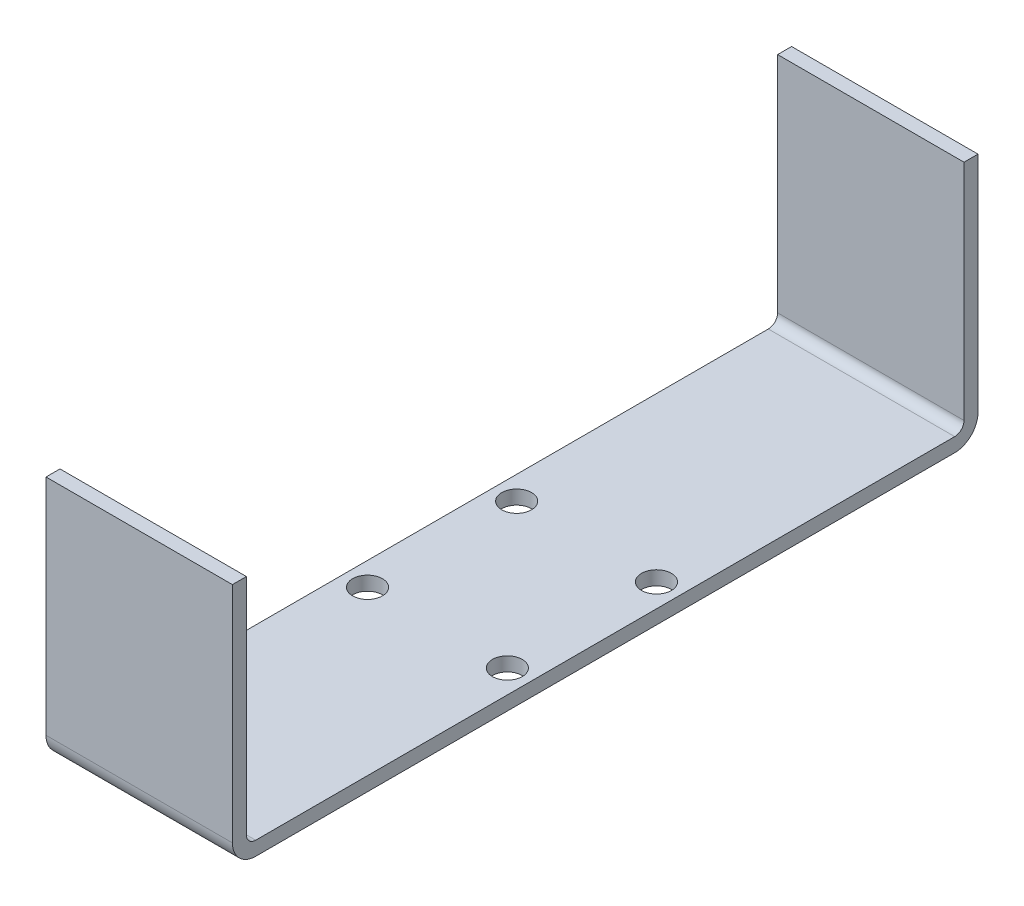
ISO-10303-21;
HEADER;
FILE_DESCRIPTION(('STEP AP214'),'2;1');
FILE_NAME('part.step','',(''),(''),'','','');
FILE_SCHEMA(('AUTOMOTIVE_DESIGN { 1 0 10303 214 1 1 1 1 }'));
ENDSEC;
DATA;
#1=APPLICATION_CONTEXT('core data for automotive mechanical design processes');
#2=APPLICATION_PROTOCOL_DEFINITION('international standard','automotive_design',2000,#1);
#3=PRODUCT_CONTEXT('',#1,'mechanical');
#4=PRODUCT('Part','Part','',(#3));
#5=PRODUCT_RELATED_PRODUCT_CATEGORY('part','',(#4));
#6=PRODUCT_DEFINITION_FORMATION('','',#4);
#7=PRODUCT_DEFINITION_CONTEXT('part definition',#1,'design');
#8=PRODUCT_DEFINITION('design','',#6,#7);
#9=PRODUCT_DEFINITION_SHAPE('','',#8);
#10=(LENGTH_UNIT() NAMED_UNIT(*) SI_UNIT(.MILLI.,.METRE.));
#11=(NAMED_UNIT(*) PLANE_ANGLE_UNIT() SI_UNIT($,.RADIAN.));
#12=(NAMED_UNIT(*) SI_UNIT($,.STERADIAN.) SOLID_ANGLE_UNIT());
#13=UNCERTAINTY_MEASURE_WITH_UNIT(LENGTH_MEASURE(1.E-05),#10,'distance_accuracy_value','');
#14=(GEOMETRIC_REPRESENTATION_CONTEXT(3) GLOBAL_UNCERTAINTY_ASSIGNED_CONTEXT((#13)) GLOBAL_UNIT_ASSIGNED_CONTEXT((#10,
#11,#12)) REPRESENTATION_CONTEXT('',''));
#15=CARTESIAN_POINT('',(0.,0.,0.));
#16=DIRECTION('',(0.,0.,1.));
#17=DIRECTION('',(1.,0.,0.));
#18=AXIS2_PLACEMENT_3D('',#15,#16,#17);
#19=CARTESIAN_POINT('',(0.,1.5,0.));
#20=DIRECTION('',(0.,1.,0.));
#21=DIRECTION('',(0.,0.,1.));
#22=AXIS2_PLACEMENT_3D('',#19,#20,#21);
#23=PLANE('',#22);
#24=CARTESIAN_POINT('',(-7.50000000000001,1.5,8.));
#25=DIRECTION('',(0.,1.,0.));
#26=DIRECTION('',(0.,0.,1.));
#27=AXIS2_PLACEMENT_3D('',#24,#25,#26);
#28=CIRCLE('',#27,1.60000000000001);
#29=CARTESIAN_POINT('',(-7.50000000000001,1.5,9.60000000000001));
#30=VERTEX_POINT('',#29);
#31=EDGE_CURVE('E205',#30,#30,#28,.T.);
#32=ORIENTED_EDGE('',*,*,#31,.F.);
#33=EDGE_LOOP('',(#32));
#34=FACE_BOUND('',#33,.T.);
#35=CARTESIAN_POINT('',(-7.50000000000001,1.5,-8.));
#36=DIRECTION('',(0.,1.,0.));
#37=DIRECTION('',(0.,0.,1.));
#38=AXIS2_PLACEMENT_3D('',#35,#36,#37);
#39=CIRCLE('',#38,1.60000000000001);
#40=CARTESIAN_POINT('',(-7.50000000000001,1.5,-6.39999999999999));
#41=VERTEX_POINT('',#40);
#42=EDGE_CURVE('E221',#41,#41,#39,.T.);
#43=ORIENTED_EDGE('',*,*,#42,.F.);
#44=EDGE_LOOP('',(#43));
#45=FACE_BOUND('',#44,.T.);
#46=CARTESIAN_POINT('',(7.49999999999999,1.5,-8.));
#47=DIRECTION('',(0.,1.,0.));
#48=DIRECTION('',(0.,0.,1.));
#49=AXIS2_PLACEMENT_3D('',#46,#47,#48);
#50=CIRCLE('',#49,1.6);
#51=CARTESIAN_POINT('',(7.49999999999999,1.5,-6.4));
#52=VERTEX_POINT('',#51);
#53=EDGE_CURVE('E213',#52,#52,#50,.T.);
#54=ORIENTED_EDGE('',*,*,#53,.F.);
#55=EDGE_LOOP('',(#54));
#56=FACE_BOUND('',#55,.T.);
#57=CARTESIAN_POINT('',(7.49999999999999,1.5,8.));
#58=DIRECTION('',(0.,1.,0.));
#59=DIRECTION('',(0.,0.,1.));
#60=AXIS2_PLACEMENT_3D('',#57,#58,#59);
#61=CIRCLE('',#60,1.60000000000001);
#62=CARTESIAN_POINT('',(7.49999999999999,1.5,9.60000000000001));
#63=VERTEX_POINT('',#62);
#64=EDGE_CURVE('E197',#63,#63,#61,.T.);
#65=ORIENTED_EDGE('',*,*,#64,.F.);
#66=EDGE_LOOP('',(#65));
#67=FACE_BOUND('',#66,.T.);
#68=DIRECTION('',(0.,0.,-1.));
#69=VECTOR('',#68,1.);
#70=CARTESIAN_POINT('',(10.,1.5,-40.));
#71=LINE('',#70,#69);
#72=CARTESIAN_POINT('',(10.,1.5,37.5));
#73=VERTEX_POINT('',#72);
#74=CARTESIAN_POINT('',(10.,1.5,-37.5));
#75=VERTEX_POINT('',#74);
#76=EDGE_CURVE('E229',#73,#75,#71,.T.);
#77=ORIENTED_EDGE('',*,*,#76,.T.);
#78=DIRECTION('',(1.,0.,0.));
#79=VECTOR('',#78,1.);
#80=CARTESIAN_POINT('',(0.,1.5,-37.5));
#81=LINE('',#80,#79);
#82=CARTESIAN_POINT('',(-10.,1.5,-37.5));
#83=VERTEX_POINT('',#82);
#84=EDGE_CURVE('E257',#75,#83,#81,.F.);
#85=ORIENTED_EDGE('',*,*,#84,.T.);
#86=DIRECTION('',(0.,0.,1.));
#87=VECTOR('',#86,1.);
#88=CARTESIAN_POINT('',(-10.,1.5,-40.));
#89=LINE('',#88,#87);
#90=CARTESIAN_POINT('',(-10.,1.5,37.5));
#91=VERTEX_POINT('',#90);
#92=EDGE_CURVE('E233',#83,#91,#89,.T.);
#93=ORIENTED_EDGE('',*,*,#92,.T.);
#94=DIRECTION('',(-1.,0.,0.));
#95=VECTOR('',#94,1.);
#96=CARTESIAN_POINT('',(0.,1.5,37.5));
#97=LINE('',#96,#95);
#98=EDGE_CURVE('E254',#91,#73,#97,.F.);
#99=ORIENTED_EDGE('',*,*,#98,.T.);
#100=EDGE_LOOP('',(#77,#85,#93,#99));
#101=FACE_BOUND('',#100,.T.);
#102=ADVANCED_FACE('F39',(#34,#45,#56,#67,#101),#23,.T.);
#103=CARTESIAN_POINT('',(0.,0.,0.));
#104=DIRECTION('',(0.,1.,0.));
#105=DIRECTION('',(0.,0.,1.));
#106=AXIS2_PLACEMENT_3D('',#103,#104,#105);
#107=PLANE('',#106);
#108=DIRECTION('',(0.,0.,1.));
#109=VECTOR('',#108,1.);
#110=CARTESIAN_POINT('',(-10.,0.,-40.));
#111=LINE('',#110,#109);
#112=CARTESIAN_POINT('',(-10.,0.,-37.5));
#113=VERTEX_POINT('',#112);
#114=CARTESIAN_POINT('',(-10.,0.,37.5));
#115=VERTEX_POINT('',#114);
#116=EDGE_CURVE('E234',#113,#115,#111,.T.);
#117=ORIENTED_EDGE('',*,*,#116,.F.);
#118=DIRECTION('',(-1.,0.,0.));
#119=VECTOR('',#118,1.);
#120=CARTESIAN_POINT('',(0.,0.,-37.5));
#121=LINE('',#120,#119);
#122=CARTESIAN_POINT('',(10.,0.,-37.5));
#123=VERTEX_POINT('',#122);
#124=EDGE_CURVE('E62',#113,#123,#121,.F.);
#125=ORIENTED_EDGE('',*,*,#124,.T.);
#126=DIRECTION('',(0.,0.,-1.));
#127=VECTOR('',#126,1.);
#128=CARTESIAN_POINT('',(10.,0.,-40.));
#129=LINE('',#128,#127);
#130=CARTESIAN_POINT('',(10.,0.,37.5));
#131=VERTEX_POINT('',#130);
#132=EDGE_CURVE('E225',#131,#123,#129,.T.);
#133=ORIENTED_EDGE('',*,*,#132,.F.);
#134=DIRECTION('',(1.,0.,0.));
#135=VECTOR('',#134,1.);
#136=CARTESIAN_POINT('',(0.,0.,37.5));
#137=LINE('',#136,#135);
#138=EDGE_CURVE('E285',#131,#115,#137,.F.);
#139=ORIENTED_EDGE('',*,*,#138,.T.);
#140=EDGE_LOOP('',(#117,#125,#133,#139));
#141=FACE_BOUND('',#140,.T.);
#142=CARTESIAN_POINT('',(-7.50000000000001,0.,-8.));
#143=DIRECTION('',(0.,1.,0.));
#144=DIRECTION('',(0.,0.,1.));
#145=AXIS2_PLACEMENT_3D('',#142,#143,#144);
#146=CIRCLE('',#145,1.60000000000001);
#147=CARTESIAN_POINT('',(-7.50000000000001,0.,-6.39999999999999));
#148=VERTEX_POINT('',#147);
#149=EDGE_CURVE('E217',#148,#148,#146,.T.);
#150=ORIENTED_EDGE('',*,*,#149,.T.);
#151=EDGE_LOOP('',(#150));
#152=FACE_BOUND('',#151,.T.);
#153=CARTESIAN_POINT('',(7.49999999999999,0.,-8.));
#154=DIRECTION('',(0.,1.,0.));
#155=DIRECTION('',(0.,0.,1.));
#156=AXIS2_PLACEMENT_3D('',#153,#154,#155);
#157=CIRCLE('',#156,1.6);
#158=CARTESIAN_POINT('',(7.49999999999999,0.,-6.4));
#159=VERTEX_POINT('',#158);
#160=EDGE_CURVE('E209',#159,#159,#157,.T.);
#161=ORIENTED_EDGE('',*,*,#160,.T.);
#162=EDGE_LOOP('',(#161));
#163=FACE_BOUND('',#162,.T.);
#164=CARTESIAN_POINT('',(-7.50000000000001,0.,8.));
#165=DIRECTION('',(0.,1.,0.));
#166=DIRECTION('',(0.,0.,1.));
#167=AXIS2_PLACEMENT_3D('',#164,#165,#166);
#168=CIRCLE('',#167,1.60000000000001);
#169=CARTESIAN_POINT('',(-7.50000000000001,0.,9.60000000000001));
#170=VERTEX_POINT('',#169);
#171=EDGE_CURVE('E201',#170,#170,#168,.T.);
#172=ORIENTED_EDGE('',*,*,#171,.T.);
#173=EDGE_LOOP('',(#172));
#174=FACE_BOUND('',#173,.T.);
#175=CARTESIAN_POINT('',(7.49999999999999,0.,8.));
#176=DIRECTION('',(0.,1.,0.));
#177=DIRECTION('',(0.,0.,1.));
#178=AXIS2_PLACEMENT_3D('',#175,#176,#177);
#179=CIRCLE('',#178,1.60000000000001);
#180=CARTESIAN_POINT('',(7.49999999999999,0.,9.60000000000001));
#181=VERTEX_POINT('',#180);
#182=EDGE_CURVE('E196',#181,#181,#179,.T.);
#183=ORIENTED_EDGE('',*,*,#182,.T.);
#184=EDGE_LOOP('',(#183));
#185=FACE_BOUND('',#184,.T.);
#186=ADVANCED_FACE('F303',(#141,#152,#163,#174,#185),#107,.F.);
#187=CARTESIAN_POINT('',(10.,1.5,-40.));
#188=DIRECTION('',(-1.,0.,0.));
#189=DIRECTION('',(0.,0.,1.));
#190=AXIS2_PLACEMENT_3D('',#187,#188,#189);
#191=PLANE('',#190);
#192=ORIENTED_EDGE('',*,*,#132,.T.);
#193=CARTESIAN_POINT('',(10.,2.5,-37.5));
#194=DIRECTION('',(-1.,0.,0.));
#195=DIRECTION('',(0.,0.,1.));
#196=AXIS2_PLACEMENT_3D('',#193,#194,#195);
#197=CIRCLE('',#196,2.5);
#198=CARTESIAN_POINT('',(10.,2.5,-40.));
#199=VERTEX_POINT('',#198);
#200=EDGE_CURVE('E48',#123,#199,#197,.F.);
#201=ORIENTED_EDGE('',*,*,#200,.T.);
#202=DIRECTION('',(0.,-1.,0.));
#203=VECTOR('',#202,1.);
#204=CARTESIAN_POINT('',(10.,1.5,-40.));
#205=LINE('',#204,#203);
#206=CARTESIAN_POINT('',(10.,26.5,-40.));
#207=VERTEX_POINT('',#206);
#208=EDGE_CURVE('E246',#207,#199,#205,.T.);
#209=ORIENTED_EDGE('',*,*,#208,.F.);
#210=DIRECTION('',(0.,0.,-1.));
#211=VECTOR('',#210,1.);
#212=CARTESIAN_POINT('',(10.,26.5,-40.));
#213=LINE('',#212,#211);
#214=CARTESIAN_POINT('',(10.,26.5,-38.5));
#215=VERTEX_POINT('',#214);
#216=EDGE_CURVE('E180',#215,#207,#213,.T.);
#217=ORIENTED_EDGE('',*,*,#216,.F.);
#218=DIRECTION('',(0.,-1.,0.));
#219=VECTOR('',#218,1.);
#220=CARTESIAN_POINT('',(10.,26.5,-38.5));
#221=LINE('',#220,#219);
#222=CARTESIAN_POINT('',(10.,2.5,-38.5));
#223=VERTEX_POINT('',#222);
#224=EDGE_CURVE('E188',#215,#223,#221,.T.);
#225=ORIENTED_EDGE('',*,*,#224,.T.);
#226=CARTESIAN_POINT('',(10.,2.5,-37.5));
#227=DIRECTION('',(-1.,0.,0.));
#228=DIRECTION('',(0.,0.,1.));
#229=AXIS2_PLACEMENT_3D('',#226,#227,#228);
#230=CIRCLE('',#229,1.);
#231=EDGE_CURVE('E264',#223,#75,#230,.T.);
#232=ORIENTED_EDGE('',*,*,#231,.T.);
#233=ORIENTED_EDGE('',*,*,#76,.F.);
#234=CARTESIAN_POINT('',(10.,2.5,37.5));
#235=DIRECTION('',(-1.,0.,0.));
#236=DIRECTION('',(0.,0.,1.));
#237=AXIS2_PLACEMENT_3D('',#234,#235,#236);
#238=CIRCLE('',#237,1.);
#239=CARTESIAN_POINT('',(10.,2.5,38.5));
#240=VERTEX_POINT('',#239);
#241=EDGE_CURVE('E273',#73,#240,#238,.T.);
#242=ORIENTED_EDGE('',*,*,#241,.T.);
#243=DIRECTION('',(0.,-1.,0.));
#244=VECTOR('',#243,1.);
#245=CARTESIAN_POINT('',(10.,26.5,38.5));
#246=LINE('',#245,#244);
#247=CARTESIAN_POINT('',(10.,26.5,38.5));
#248=VERTEX_POINT('',#247);
#249=EDGE_CURVE('E169',#248,#240,#246,.T.);
#250=ORIENTED_EDGE('',*,*,#249,.F.);
#251=DIRECTION('',(0.,0.,-1.));
#252=VECTOR('',#251,1.);
#253=CARTESIAN_POINT('',(10.,26.5,40.));
#254=LINE('',#253,#252);
#255=CARTESIAN_POINT('',(10.,26.5,40.));
#256=VERTEX_POINT('',#255);
#257=EDGE_CURVE('E153',#256,#248,#254,.T.);
#258=ORIENTED_EDGE('',*,*,#257,.F.);
#259=DIRECTION('',(0.,-1.,0.));
#260=VECTOR('',#259,1.);
#261=CARTESIAN_POINT('',(10.,1.5,40.));
#262=LINE('',#261,#260);
#263=CARTESIAN_POINT('',(10.,2.5,40.));
#264=VERTEX_POINT('',#263);
#265=EDGE_CURVE('E144',#256,#264,#262,.T.);
#266=ORIENTED_EDGE('',*,*,#265,.T.);
#267=CARTESIAN_POINT('',(10.,2.5,37.5));
#268=DIRECTION('',(-1.,0.,0.));
#269=DIRECTION('',(0.,0.,1.));
#270=AXIS2_PLACEMENT_3D('',#267,#268,#269);
#271=CIRCLE('',#270,2.5);
#272=EDGE_CURVE('E55',#264,#131,#271,.F.);
#273=ORIENTED_EDGE('',*,*,#272,.T.);
#274=EDGE_LOOP('',(#192,#201,#209,#217,#225,#232,#233,#242,#250,#258,#266,#273));
#275=FACE_BOUND('',#274,.T.);
#276=ADVANCED_FACE('F294',(#275),#191,.F.);
#277=CARTESIAN_POINT('',(-10.,1.5,-40.));
#278=DIRECTION('',(0.,0.,1.));
#279=DIRECTION('',(1.,0.,0.));
#280=AXIS2_PLACEMENT_3D('',#277,#278,#279);
#281=PLANE('',#280);
#282=ORIENTED_EDGE('',*,*,#208,.T.);
#283=DIRECTION('',(-1.,0.,0.));
#284=VECTOR('',#283,1.);
#285=CARTESIAN_POINT('',(-10.,2.5,-40.));
#286=LINE('',#285,#284);
#287=CARTESIAN_POINT('',(-10.,2.5,-40.));
#288=VERTEX_POINT('',#287);
#289=EDGE_CURVE('E276',#199,#288,#286,.T.);
#290=ORIENTED_EDGE('',*,*,#289,.T.);
#291=DIRECTION('',(0.,-1.,0.));
#292=VECTOR('',#291,1.);
#293=CARTESIAN_POINT('',(-10.,1.5,-40.));
#294=LINE('',#293,#292);
#295=CARTESIAN_POINT('',(-10.,26.5,-40.));
#296=VERTEX_POINT('',#295);
#297=EDGE_CURVE('E143',#296,#288,#294,.T.);
#298=ORIENTED_EDGE('',*,*,#297,.F.);
#299=DIRECTION('',(-1.,0.,0.));
#300=VECTOR('',#299,1.);
#301=CARTESIAN_POINT('',(-10.,26.5,-40.));
#302=LINE('',#301,#300);
#303=EDGE_CURVE('E184',#207,#296,#302,.T.);
#304=ORIENTED_EDGE('',*,*,#303,.F.);
#305=EDGE_LOOP('',(#282,#290,#298,#304));
#306=FACE_BOUND('',#305,.T.);
#307=ADVANCED_FACE('F300',(#306),#281,.F.);
#308=CARTESIAN_POINT('',(-10.,1.5,-40.));
#309=DIRECTION('',(1.,0.,0.));
#310=DIRECTION('',(0.,0.,-1.));
#311=AXIS2_PLACEMENT_3D('',#308,#309,#310);
#312=PLANE('',#311);
#313=ORIENTED_EDGE('',*,*,#297,.T.);
#314=CARTESIAN_POINT('',(-10.,2.5,-37.5));
#315=DIRECTION('',(1.,0.,0.));
#316=DIRECTION('',(0.,0.,-1.));
#317=AXIS2_PLACEMENT_3D('',#314,#315,#316);
#318=CIRCLE('',#317,2.5);
#319=EDGE_CURVE('E282',#288,#113,#318,.F.);
#320=ORIENTED_EDGE('',*,*,#319,.T.);
#321=ORIENTED_EDGE('',*,*,#116,.T.);
#322=CARTESIAN_POINT('',(-10.,2.5,37.5));
#323=DIRECTION('',(1.,0.,0.));
#324=DIRECTION('',(0.,0.,-1.));
#325=AXIS2_PLACEMENT_3D('',#322,#323,#324);
#326=CIRCLE('',#325,2.5);
#327=CARTESIAN_POINT('',(-10.,2.5,40.));
#328=VERTEX_POINT('',#327);
#329=EDGE_CURVE('E140',#115,#328,#326,.F.);
#330=ORIENTED_EDGE('',*,*,#329,.T.);
#331=DIRECTION('',(0.,-1.,0.));
#332=VECTOR('',#331,1.);
#333=CARTESIAN_POINT('',(-10.,1.5,40.));
#334=LINE('',#333,#332);
#335=CARTESIAN_POINT('',(-10.,26.5,40.));
#336=VERTEX_POINT('',#335);
#337=EDGE_CURVE('E131',#336,#328,#334,.T.);
#338=ORIENTED_EDGE('',*,*,#337,.F.);
#339=DIRECTION('',(0.,0.,1.));
#340=VECTOR('',#339,1.);
#341=CARTESIAN_POINT('',(-10.,26.5,40.));
#342=LINE('',#341,#340);
#343=CARTESIAN_POINT('',(-10.,26.5,38.5));
#344=VERTEX_POINT('',#343);
#345=EDGE_CURVE('E137',#344,#336,#342,.T.);
#346=ORIENTED_EDGE('',*,*,#345,.F.);
#347=DIRECTION('',(0.,-1.,0.));
#348=VECTOR('',#347,1.);
#349=CARTESIAN_POINT('',(-10.,26.5,38.5));
#350=LINE('',#349,#348);
#351=CARTESIAN_POINT('',(-10.,2.5,38.5));
#352=VERTEX_POINT('',#351);
#353=EDGE_CURVE('E166',#344,#352,#350,.T.);
#354=ORIENTED_EDGE('',*,*,#353,.T.);
#355=CARTESIAN_POINT('',(-10.,2.5,37.5));
#356=DIRECTION('',(1.,0.,0.));
#357=DIRECTION('',(0.,0.,-1.));
#358=AXIS2_PLACEMENT_3D('',#355,#356,#357);
#359=CIRCLE('',#358,1.);
#360=EDGE_CURVE('E270',#352,#91,#359,.T.);
#361=ORIENTED_EDGE('',*,*,#360,.T.);
#362=ORIENTED_EDGE('',*,*,#92,.F.);
#363=CARTESIAN_POINT('',(-10.,2.5,-37.5));
#364=DIRECTION('',(1.,0.,0.));
#365=DIRECTION('',(0.,0.,-1.));
#366=AXIS2_PLACEMENT_3D('',#363,#364,#365);
#367=CIRCLE('',#366,1.);
#368=CARTESIAN_POINT('',(-10.,2.5,-38.5));
#369=VERTEX_POINT('',#368);
#370=EDGE_CURVE('E267',#83,#369,#367,.T.);
#371=ORIENTED_EDGE('',*,*,#370,.T.);
#372=DIRECTION('',(0.,-1.,0.));
#373=VECTOR('',#372,1.);
#374=CARTESIAN_POINT('',(-10.,26.5,-38.5));
#375=LINE('',#374,#373);
#376=CARTESIAN_POINT('',(-10.,26.5,-38.5));
#377=VERTEX_POINT('',#376);
#378=EDGE_CURVE('E192',#377,#369,#375,.T.);
#379=ORIENTED_EDGE('',*,*,#378,.F.);
#380=DIRECTION('',(0.,0.,1.));
#381=VECTOR('',#380,1.);
#382=CARTESIAN_POINT('',(-10.,26.5,-40.));
#383=LINE('',#382,#381);
#384=EDGE_CURVE('E173',#296,#377,#383,.T.);
#385=ORIENTED_EDGE('',*,*,#384,.F.);
#386=EDGE_LOOP('',(#313,#320,#321,#330,#338,#346,#354,#361,#362,#371,#379,#385));
#387=FACE_BOUND('',#386,.T.);
#388=ADVANCED_FACE('F134',(#387),#312,.F.);
#389=CARTESIAN_POINT('',(-10.,1.5,40.));
#390=DIRECTION('',(0.,0.,-1.));
#391=DIRECTION('',(-1.,0.,0.));
#392=AXIS2_PLACEMENT_3D('',#389,#390,#391);
#393=PLANE('',#392);
#394=ORIENTED_EDGE('',*,*,#337,.T.);
#395=DIRECTION('',(1.,0.,0.));
#396=VECTOR('',#395,1.);
#397=CARTESIAN_POINT('',(-10.,2.5,40.));
#398=LINE('',#397,#396);
#399=EDGE_CURVE('E11',#328,#264,#398,.T.);
#400=ORIENTED_EDGE('',*,*,#399,.T.);
#401=ORIENTED_EDGE('',*,*,#265,.F.);
#402=DIRECTION('',(1.,0.,0.));
#403=VECTOR('',#402,1.);
#404=CARTESIAN_POINT('',(-10.,26.5,40.));
#405=LINE('',#404,#403);
#406=EDGE_CURVE('E147',#336,#256,#405,.T.);
#407=ORIENTED_EDGE('',*,*,#406,.F.);
#408=EDGE_LOOP('',(#394,#400,#401,#407));
#409=FACE_BOUND('',#408,.T.);
#410=ADVANCED_FACE('F148',(#409),#393,.F.);
#411=CARTESIAN_POINT('',(-7.50000000000001,1.5,-8.));
#412=DIRECTION('',(0.,-1.,0.));
#413=DIRECTION('',(0.,0.,-1.));
#414=AXIS2_PLACEMENT_3D('',#411,#412,#413);
#415=CYLINDRICAL_SURFACE('',#414,1.60000000000001);
#416=ORIENTED_EDGE('',*,*,#42,.T.);
#417=EDGE_LOOP('',(#416));
#418=FACE_BOUND('',#417,.T.);
#419=ORIENTED_EDGE('',*,*,#149,.F.);
#420=EDGE_LOOP('',(#419));
#421=FACE_BOUND('',#420,.T.);
#422=ADVANCED_FACE('F337',(#418,#421),#415,.F.);
#423=CARTESIAN_POINT('',(7.49999999999999,1.5,-8.));
#424=DIRECTION('',(0.,-1.,0.));
#425=DIRECTION('',(0.,0.,-1.));
#426=AXIS2_PLACEMENT_3D('',#423,#424,#425);
#427=CYLINDRICAL_SURFACE('',#426,1.6);
#428=ORIENTED_EDGE('',*,*,#53,.T.);
#429=EDGE_LOOP('',(#428));
#430=FACE_BOUND('',#429,.T.);
#431=ORIENTED_EDGE('',*,*,#160,.F.);
#432=EDGE_LOOP('',(#431));
#433=FACE_BOUND('',#432,.T.);
#434=ADVANCED_FACE('F370',(#430,#433),#427,.F.);
#435=CARTESIAN_POINT('',(-7.50000000000001,1.5,8.));
#436=DIRECTION('',(0.,-1.,0.));
#437=DIRECTION('',(0.,0.,-1.));
#438=AXIS2_PLACEMENT_3D('',#435,#436,#437);
#439=CYLINDRICAL_SURFACE('',#438,1.60000000000001);
#440=ORIENTED_EDGE('',*,*,#31,.T.);
#441=EDGE_LOOP('',(#440));
#442=FACE_BOUND('',#441,.T.);
#443=ORIENTED_EDGE('',*,*,#171,.F.);
#444=EDGE_LOOP('',(#443));
#445=FACE_BOUND('',#444,.T.);
#446=ADVANCED_FACE('F377',(#442,#445),#439,.F.);
#447=CARTESIAN_POINT('',(7.49999999999999,1.5,8.));
#448=DIRECTION('',(0.,-1.,0.));
#449=DIRECTION('',(0.,0.,-1.));
#450=AXIS2_PLACEMENT_3D('',#447,#448,#449);
#451=CYLINDRICAL_SURFACE('',#450,1.60000000000001);
#452=ORIENTED_EDGE('',*,*,#64,.T.);
#453=EDGE_LOOP('',(#452));
#454=FACE_BOUND('',#453,.T.);
#455=ORIENTED_EDGE('',*,*,#182,.F.);
#456=EDGE_LOOP('',(#455));
#457=FACE_BOUND('',#456,.T.);
#458=ADVANCED_FACE('F384',(#454,#457),#451,.F.);
#459=CARTESIAN_POINT('',(-10.,26.5,-38.5));
#460=DIRECTION('',(0.,0.,-1.));
#461=DIRECTION('',(-1.,0.,0.));
#462=AXIS2_PLACEMENT_3D('',#459,#460,#461);
#463=PLANE('',#462);
#464=ORIENTED_EDGE('',*,*,#378,.T.);
#465=DIRECTION('',(1.,0.,0.));
#466=VECTOR('',#465,1.);
#467=CARTESIAN_POINT('',(-10.,2.5,-38.5));
#468=LINE('',#467,#466);
#469=EDGE_CURVE('E250',#369,#223,#468,.T.);
#470=ORIENTED_EDGE('',*,*,#469,.T.);
#471=ORIENTED_EDGE('',*,*,#224,.F.);
#472=DIRECTION('',(1.,0.,0.));
#473=VECTOR('',#472,1.);
#474=CARTESIAN_POINT('',(-10.,26.5,-38.5));
#475=LINE('',#474,#473);
#476=EDGE_CURVE('E177',#377,#215,#475,.T.);
#477=ORIENTED_EDGE('',*,*,#476,.F.);
#478=EDGE_LOOP('',(#464,#470,#471,#477));
#479=FACE_BOUND('',#478,.T.);
#480=ADVANCED_FACE('F392',(#479),#463,.F.);
#481=CARTESIAN_POINT('',(0.,26.5,0.));
#482=DIRECTION('',(0.,1.,0.));
#483=DIRECTION('',(0.,0.,1.));
#484=AXIS2_PLACEMENT_3D('',#481,#482,#483);
#485=PLANE('',#484);
#486=ORIENTED_EDGE('',*,*,#384,.T.);
#487=ORIENTED_EDGE('',*,*,#476,.T.);
#488=ORIENTED_EDGE('',*,*,#216,.T.);
#489=ORIENTED_EDGE('',*,*,#303,.T.);
#490=EDGE_LOOP('',(#486,#487,#488,#489));
#491=FACE_BOUND('',#490,.T.);
#492=ADVANCED_FACE('F401',(#491),#485,.T.);
#493=CARTESIAN_POINT('',(-10.,26.5,38.5));
#494=DIRECTION('',(0.,0.,1.));
#495=DIRECTION('',(1.,0.,0.));
#496=AXIS2_PLACEMENT_3D('',#493,#494,#495);
#497=PLANE('',#496);
#498=ORIENTED_EDGE('',*,*,#249,.T.);
#499=DIRECTION('',(-1.,0.,0.));
#500=VECTOR('',#499,1.);
#501=CARTESIAN_POINT('',(-10.,2.5,38.5));
#502=LINE('',#501,#500);
#503=EDGE_CURVE('E260',#240,#352,#502,.T.);
#504=ORIENTED_EDGE('',*,*,#503,.T.);
#505=ORIENTED_EDGE('',*,*,#353,.F.);
#506=DIRECTION('',(-1.,0.,0.));
#507=VECTOR('',#506,1.);
#508=CARTESIAN_POINT('',(-10.,26.5,38.5));
#509=LINE('',#508,#507);
#510=EDGE_CURVE('E157',#248,#344,#509,.T.);
#511=ORIENTED_EDGE('',*,*,#510,.F.);
#512=EDGE_LOOP('',(#498,#504,#505,#511));
#513=FACE_BOUND('',#512,.T.);
#514=ADVANCED_FACE('F310',(#513),#497,.F.);
#515=CARTESIAN_POINT('',(0.,26.5,0.));
#516=DIRECTION('',(0.,-1.,0.));
#517=DIRECTION('',(0.,0.,-1.));
#518=AXIS2_PLACEMENT_3D('',#515,#516,#517);
#519=PLANE('',#518);
#520=ORIENTED_EDGE('',*,*,#345,.T.);
#521=ORIENTED_EDGE('',*,*,#406,.T.);
#522=ORIENTED_EDGE('',*,*,#257,.T.);
#523=ORIENTED_EDGE('',*,*,#510,.T.);
#524=EDGE_LOOP('',(#520,#521,#522,#523));
#525=FACE_BOUND('',#524,.T.);
#526=ADVANCED_FACE('F155',(#525),#519,.F.);
#527=CARTESIAN_POINT('',(-10.,2.5,-37.5));
#528=DIRECTION('',(1.,0.,0.));
#529=DIRECTION('',(0.,0.,-1.));
#530=AXIS2_PLACEMENT_3D('',#527,#528,#529);
#531=CYLINDRICAL_SURFACE('',#530,1.);
#532=ORIENTED_EDGE('',*,*,#370,.F.);
#533=ORIENTED_EDGE('',*,*,#84,.F.);
#534=ORIENTED_EDGE('',*,*,#231,.F.);
#535=ORIENTED_EDGE('',*,*,#469,.F.);
#536=EDGE_LOOP('',(#532,#533,#534,#535));
#537=FACE_BOUND('',#536,.T.);
#538=ADVANCED_FACE('F319',(#537),#531,.F.);
#539=CARTESIAN_POINT('',(-10.,2.5,37.5));
#540=DIRECTION('',(-1.,0.,0.));
#541=DIRECTION('',(0.,0.,1.));
#542=AXIS2_PLACEMENT_3D('',#539,#540,#541);
#543=CYLINDRICAL_SURFACE('',#542,1.);
#544=ORIENTED_EDGE('',*,*,#241,.F.);
#545=ORIENTED_EDGE('',*,*,#98,.F.);
#546=ORIENTED_EDGE('',*,*,#360,.F.);
#547=ORIENTED_EDGE('',*,*,#503,.F.);
#548=EDGE_LOOP('',(#544,#545,#546,#547));
#549=FACE_BOUND('',#548,.T.);
#550=ADVANCED_FACE('F317',(#549),#543,.F.);
#551=CARTESIAN_POINT('',(-10.,2.5,-37.5));
#552=DIRECTION('',(-1.,0.,0.));
#553=DIRECTION('',(0.,0.,1.));
#554=AXIS2_PLACEMENT_3D('',#551,#552,#553);
#555=CYLINDRICAL_SURFACE('',#554,2.5);
#556=ORIENTED_EDGE('',*,*,#200,.F.);
#557=ORIENTED_EDGE('',*,*,#124,.F.);
#558=ORIENTED_EDGE('',*,*,#319,.F.);
#559=ORIENTED_EDGE('',*,*,#289,.F.);
#560=EDGE_LOOP('',(#556,#557,#558,#559));
#561=FACE_BOUND('',#560,.T.);
#562=ADVANCED_FACE('F301',(#561),#555,.T.);
#563=CARTESIAN_POINT('',(-10.,2.5,37.5));
#564=DIRECTION('',(1.,0.,0.));
#565=DIRECTION('',(0.,0.,-1.));
#566=AXIS2_PLACEMENT_3D('',#563,#564,#565);
#567=CYLINDRICAL_SURFACE('',#566,2.5);
#568=ORIENTED_EDGE('',*,*,#329,.F.);
#569=ORIENTED_EDGE('',*,*,#138,.F.);
#570=ORIENTED_EDGE('',*,*,#272,.F.);
#571=ORIENTED_EDGE('',*,*,#399,.F.);
#572=EDGE_LOOP('',(#568,#569,#570,#571));
#573=FACE_BOUND('',#572,.T.);
#574=ADVANCED_FACE('F41',(#573),#567,.T.);
#575=CLOSED_SHELL('',(#102,#186,#276,#307,#388,#410,#422,#434,#446,#458,#480,#492,#514,#526,
#538,#550,#562,#574));
#576=MANIFOLD_SOLID_BREP('B2',#575);
#577=ADVANCED_BREP_SHAPE_REPRESENTATION('',(#18,#576),#14);
#578=SHAPE_DEFINITION_REPRESENTATION(#9,#577);
ENDSEC;
END-ISO-10303-21;
